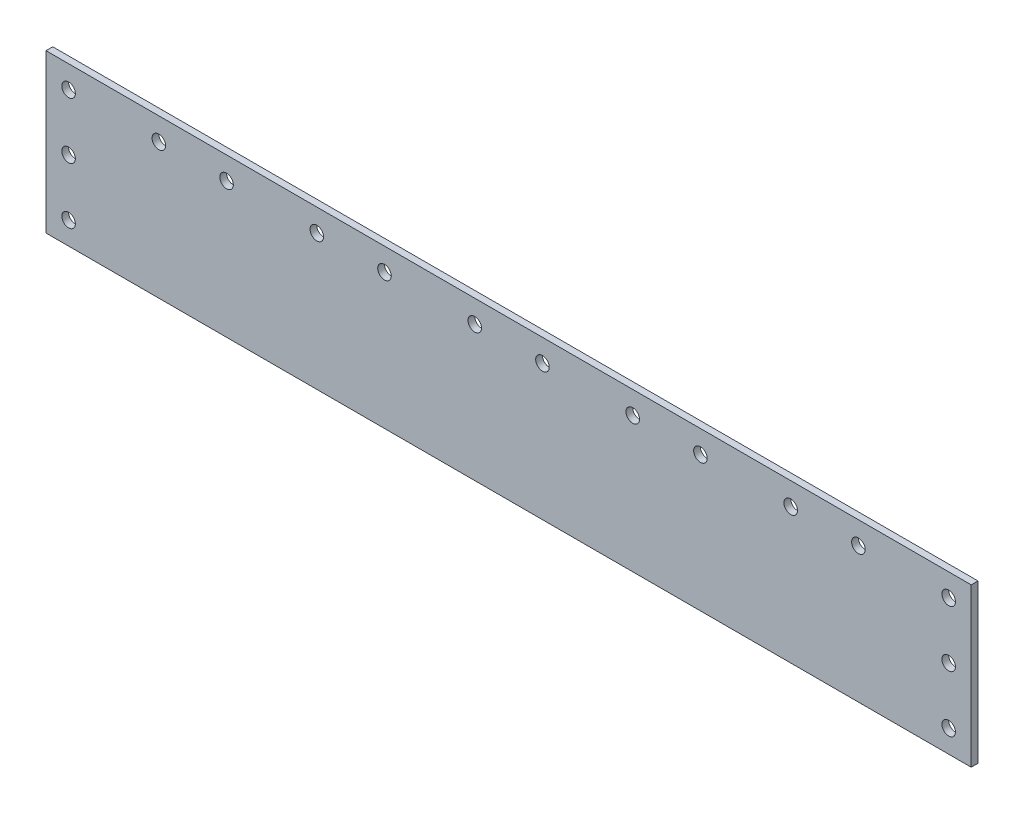
ISO-10303-21;
HEADER;
FILE_DESCRIPTION(('STEP AP214'),'2;1');
FILE_NAME('part.step','',(''),(''),'','','');
FILE_SCHEMA(('AUTOMOTIVE_DESIGN { 1 0 10303 214 1 1 1 1 }'));
ENDSEC;
DATA;
#1=APPLICATION_CONTEXT('core data for automotive mechanical design processes');
#2=APPLICATION_PROTOCOL_DEFINITION('international standard','automotive_design',2000,#1);
#3=PRODUCT_CONTEXT('',#1,'mechanical');
#4=PRODUCT('Part','Part','',(#3));
#5=PRODUCT_RELATED_PRODUCT_CATEGORY('part','',(#4));
#6=PRODUCT_DEFINITION_FORMATION('','',#4);
#7=PRODUCT_DEFINITION_CONTEXT('part definition',#1,'design');
#8=PRODUCT_DEFINITION('design','',#6,#7);
#9=PRODUCT_DEFINITION_SHAPE('','',#8);
#10=(LENGTH_UNIT() NAMED_UNIT(*) SI_UNIT(.MILLI.,.METRE.));
#11=(NAMED_UNIT(*) PLANE_ANGLE_UNIT() SI_UNIT($,.RADIAN.));
#12=(NAMED_UNIT(*) SI_UNIT($,.STERADIAN.) SOLID_ANGLE_UNIT());
#13=UNCERTAINTY_MEASURE_WITH_UNIT(LENGTH_MEASURE(1.E-05),#10,'distance_accuracy_value','');
#14=(GEOMETRIC_REPRESENTATION_CONTEXT(3) GLOBAL_UNCERTAINTY_ASSIGNED_CONTEXT((#13)) GLOBAL_UNIT_ASSIGNED_CONTEXT((#10,
#11,#12)) REPRESENTATION_CONTEXT('',''));
#15=CARTESIAN_POINT('',(0.,0.,0.));
#16=DIRECTION('',(0.,0.,1.));
#17=DIRECTION('',(1.,0.,0.));
#18=AXIS2_PLACEMENT_3D('',#15,#16,#17);
#19=CARTESIAN_POINT('',(0.,0.,3.));
#20=DIRECTION('',(0.,0.,-1.));
#21=DIRECTION('',(-1.,0.,0.));
#22=AXIS2_PLACEMENT_3D('',#19,#20,#21);
#23=PLANE('',#22);
#24=CARTESIAN_POINT('',(400.,35.,3.));
#25=DIRECTION('',(0.,0.,1.));
#26=DIRECTION('',(1.,0.,0.));
#27=AXIS2_PLACEMENT_3D('',#24,#25,#26);
#28=CIRCLE('',#27,2.99999999999999);
#29=CARTESIAN_POINT('',(403.,35.,3.));
#30=VERTEX_POINT('',#29);
#31=EDGE_CURVE('E192',#30,#30,#28,.T.);
#32=ORIENTED_EDGE('',*,*,#31,.F.);
#33=EDGE_LOOP('',(#32));
#34=FACE_BOUND('',#33,.T.);
#35=CARTESIAN_POINT('',(400.,10.,3.));
#36=DIRECTION('',(0.,0.,1.));
#37=DIRECTION('',(-1.,0.,0.));
#38=AXIS2_PLACEMENT_3D('',#35,#36,#37);
#39=CIRCLE('',#38,2.99999999999999);
#40=CARTESIAN_POINT('',(397.,10.,3.));
#41=VERTEX_POINT('',#40);
#42=EDGE_CURVE('E180',#41,#41,#39,.T.);
#43=ORIENTED_EDGE('',*,*,#42,.F.);
#44=EDGE_LOOP('',(#43));
#45=FACE_BOUND('',#44,.T.);
#46=CARTESIAN_POINT('',(360.,60.,3.));
#47=DIRECTION('',(0.,0.,1.));
#48=DIRECTION('',(1.,0.,0.));
#49=AXIS2_PLACEMENT_3D('',#46,#47,#48);
#50=CIRCLE('',#49,2.99999999999999);
#51=CARTESIAN_POINT('',(363.,60.,3.));
#52=VERTEX_POINT('',#51);
#53=EDGE_CURVE('E168',#52,#52,#50,.T.);
#54=ORIENTED_EDGE('',*,*,#53,.F.);
#55=EDGE_LOOP('',(#54));
#56=FACE_BOUND('',#55,.T.);
#57=CARTESIAN_POINT('',(290.,60.,3.));
#58=DIRECTION('',(0.,0.,1.));
#59=DIRECTION('',(1.,0.,0.));
#60=AXIS2_PLACEMENT_3D('',#57,#58,#59);
#61=CIRCLE('',#60,2.99999999999999);
#62=CARTESIAN_POINT('',(293.,60.,3.));
#63=VERTEX_POINT('',#62);
#64=EDGE_CURVE('E156',#63,#63,#61,.T.);
#65=ORIENTED_EDGE('',*,*,#64,.F.);
#66=EDGE_LOOP('',(#65));
#67=FACE_BOUND('',#66,.T.);
#68=CARTESIAN_POINT('',(220.,60.,3.));
#69=DIRECTION('',(0.,0.,1.));
#70=DIRECTION('',(1.,0.,0.));
#71=AXIS2_PLACEMENT_3D('',#68,#69,#70);
#72=CIRCLE('',#71,2.99999999999999);
#73=CARTESIAN_POINT('',(223.,60.,3.));
#74=VERTEX_POINT('',#73);
#75=EDGE_CURVE('E144',#74,#74,#72,.T.);
#76=ORIENTED_EDGE('',*,*,#75,.F.);
#77=EDGE_LOOP('',(#76));
#78=FACE_BOUND('',#77,.T.);
#79=CARTESIAN_POINT('',(150.,60.,3.));
#80=DIRECTION('',(0.,0.,1.));
#81=DIRECTION('',(1.,0.,0.));
#82=AXIS2_PLACEMENT_3D('',#79,#80,#81);
#83=CIRCLE('',#82,2.99999999999999);
#84=CARTESIAN_POINT('',(153.,60.,3.));
#85=VERTEX_POINT('',#84);
#86=EDGE_CURVE('E132',#85,#85,#83,.T.);
#87=ORIENTED_EDGE('',*,*,#86,.F.);
#88=EDGE_LOOP('',(#87));
#89=FACE_BOUND('',#88,.T.);
#90=CARTESIAN_POINT('',(80.,60.,3.));
#91=DIRECTION('',(0.,0.,1.));
#92=DIRECTION('',(1.,0.,0.));
#93=AXIS2_PLACEMENT_3D('',#90,#91,#92);
#94=CIRCLE('',#93,3.00000000000001);
#95=CARTESIAN_POINT('',(83.,60.,3.));
#96=VERTEX_POINT('',#95);
#97=EDGE_CURVE('E120',#96,#96,#94,.T.);
#98=ORIENTED_EDGE('',*,*,#97,.F.);
#99=EDGE_LOOP('',(#98));
#100=FACE_BOUND('',#99,.T.);
#101=CARTESIAN_POINT('',(10.,60.,3.));
#102=DIRECTION('',(0.,0.,1.));
#103=DIRECTION('',(1.,0.,0.));
#104=AXIS2_PLACEMENT_3D('',#101,#102,#103);
#105=CIRCLE('',#104,3.);
#106=CARTESIAN_POINT('',(13.,60.,3.));
#107=VERTEX_POINT('',#106);
#108=EDGE_CURVE('E99',#107,#107,#105,.T.);
#109=ORIENTED_EDGE('',*,*,#108,.F.);
#110=EDGE_LOOP('',(#109));
#111=FACE_BOUND('',#110,.T.);
#112=DIRECTION('',(0.,-1.,0.));
#113=VECTOR('',#112,1.);
#114=CARTESIAN_POINT('',(0.,0.,3.));
#115=LINE('',#114,#113);
#116=CARTESIAN_POINT('',(0.,70.,3.));
#117=VERTEX_POINT('',#116);
#118=CARTESIAN_POINT('',(0.,0.,3.));
#119=VERTEX_POINT('',#118);
#120=EDGE_CURVE('E84',#117,#119,#115,.T.);
#121=ORIENTED_EDGE('',*,*,#120,.T.);
#122=DIRECTION('',(1.,0.,0.));
#123=VECTOR('',#122,1.);
#124=CARTESIAN_POINT('',(0.,0.,3.));
#125=LINE('',#124,#123);
#126=CARTESIAN_POINT('',(410.,0.,3.));
#127=VERTEX_POINT('',#126);
#128=EDGE_CURVE('E79',#119,#127,#125,.T.);
#129=ORIENTED_EDGE('',*,*,#128,.T.);
#130=DIRECTION('',(0.,1.,0.));
#131=VECTOR('',#130,1.);
#132=CARTESIAN_POINT('',(410.,0.,3.));
#133=LINE('',#132,#131);
#134=CARTESIAN_POINT('',(410.,70.,3.));
#135=VERTEX_POINT('',#134);
#136=EDGE_CURVE('E82',#127,#135,#133,.T.);
#137=ORIENTED_EDGE('',*,*,#136,.T.);
#138=DIRECTION('',(-1.,0.,0.));
#139=VECTOR('',#138,1.);
#140=CARTESIAN_POINT('',(0.,70.,3.));
#141=LINE('',#140,#139);
#142=EDGE_CURVE('E49',#135,#117,#141,.T.);
#143=ORIENTED_EDGE('',*,*,#142,.T.);
#144=EDGE_LOOP('',(#121,#129,#137,#143));
#145=FACE_BOUND('',#144,.T.);
#146=CARTESIAN_POINT('',(50.,60.,3.));
#147=DIRECTION('',(0.,0.,1.));
#148=DIRECTION('',(1.,0.,0.));
#149=AXIS2_PLACEMENT_3D('',#146,#147,#148);
#150=CIRCLE('',#149,3.);
#151=CARTESIAN_POINT('',(53.,60.,3.));
#152=VERTEX_POINT('',#151);
#153=EDGE_CURVE('E114',#152,#152,#150,.T.);
#154=ORIENTED_EDGE('',*,*,#153,.F.);
#155=EDGE_LOOP('',(#154));
#156=FACE_BOUND('',#155,.T.);
#157=CARTESIAN_POINT('',(120.,60.,3.));
#158=DIRECTION('',(0.,0.,1.));
#159=DIRECTION('',(1.,0.,0.));
#160=AXIS2_PLACEMENT_3D('',#157,#158,#159);
#161=CIRCLE('',#160,3.00000000000001);
#162=CARTESIAN_POINT('',(123.,60.,3.));
#163=VERTEX_POINT('',#162);
#164=EDGE_CURVE('E126',#163,#163,#161,.T.);
#165=ORIENTED_EDGE('',*,*,#164,.F.);
#166=EDGE_LOOP('',(#165));
#167=FACE_BOUND('',#166,.T.);
#168=CARTESIAN_POINT('',(190.,60.,3.));
#169=DIRECTION('',(0.,0.,1.));
#170=DIRECTION('',(1.,0.,0.));
#171=AXIS2_PLACEMENT_3D('',#168,#169,#170);
#172=CIRCLE('',#171,2.99999999999999);
#173=CARTESIAN_POINT('',(193.,60.,3.));
#174=VERTEX_POINT('',#173);
#175=EDGE_CURVE('E138',#174,#174,#172,.T.);
#176=ORIENTED_EDGE('',*,*,#175,.F.);
#177=EDGE_LOOP('',(#176));
#178=FACE_BOUND('',#177,.T.);
#179=CARTESIAN_POINT('',(260.,60.,3.));
#180=DIRECTION('',(0.,0.,1.));
#181=DIRECTION('',(1.,0.,0.));
#182=AXIS2_PLACEMENT_3D('',#179,#180,#181);
#183=CIRCLE('',#182,2.99999999999999);
#184=CARTESIAN_POINT('',(263.,60.,3.));
#185=VERTEX_POINT('',#184);
#186=EDGE_CURVE('E150',#185,#185,#183,.T.);
#187=ORIENTED_EDGE('',*,*,#186,.F.);
#188=EDGE_LOOP('',(#187));
#189=FACE_BOUND('',#188,.T.);
#190=CARTESIAN_POINT('',(330.,60.,3.));
#191=DIRECTION('',(0.,0.,1.));
#192=DIRECTION('',(1.,0.,0.));
#193=AXIS2_PLACEMENT_3D('',#190,#191,#192);
#194=CIRCLE('',#193,2.99999999999999);
#195=CARTESIAN_POINT('',(333.,60.,3.));
#196=VERTEX_POINT('',#195);
#197=EDGE_CURVE('E162',#196,#196,#194,.T.);
#198=ORIENTED_EDGE('',*,*,#197,.F.);
#199=EDGE_LOOP('',(#198));
#200=FACE_BOUND('',#199,.T.);
#201=CARTESIAN_POINT('',(400.,60.,3.));
#202=DIRECTION('',(0.,0.,1.));
#203=DIRECTION('',(1.,0.,0.));
#204=AXIS2_PLACEMENT_3D('',#201,#202,#203);
#205=CIRCLE('',#204,2.99999999999999);
#206=CARTESIAN_POINT('',(403.,60.,3.));
#207=VERTEX_POINT('',#206);
#208=EDGE_CURVE('E174',#207,#207,#205,.T.);
#209=ORIENTED_EDGE('',*,*,#208,.F.);
#210=EDGE_LOOP('',(#209));
#211=FACE_BOUND('',#210,.T.);
#212=CARTESIAN_POINT('',(9.99999999999999,10.,3.));
#213=DIRECTION('',(0.,0.,1.));
#214=DIRECTION('',(-1.,0.,0.));
#215=AXIS2_PLACEMENT_3D('',#212,#213,#214);
#216=CIRCLE('',#215,3.);
#217=CARTESIAN_POINT('',(6.99999999999999,10.,3.));
#218=VERTEX_POINT('',#217);
#219=EDGE_CURVE('E186',#218,#218,#216,.T.);
#220=ORIENTED_EDGE('',*,*,#219,.F.);
#221=EDGE_LOOP('',(#220));
#222=FACE_BOUND('',#221,.T.);
#223=CARTESIAN_POINT('',(10.,35.,3.));
#224=DIRECTION('',(0.,0.,1.));
#225=DIRECTION('',(1.,0.,0.));
#226=AXIS2_PLACEMENT_3D('',#223,#224,#225);
#227=CIRCLE('',#226,3.);
#228=CARTESIAN_POINT('',(13.,35.,3.));
#229=VERTEX_POINT('',#228);
#230=EDGE_CURVE('E198',#229,#229,#227,.T.);
#231=ORIENTED_EDGE('',*,*,#230,.F.);
#232=EDGE_LOOP('',(#231));
#233=FACE_BOUND('',#232,.T.);
#234=ADVANCED_FACE('F32',(#34,#45,#56,#67,#78,#89,#100,#111,#145,#156,#167,#178,#189,#200,#211,
#222,#233),#23,.F.);
#235=CARTESIAN_POINT('',(0.,0.,0.));
#236=DIRECTION('',(0.,0.,-1.));
#237=DIRECTION('',(-1.,0.,0.));
#238=AXIS2_PLACEMENT_3D('',#235,#236,#237);
#239=PLANE('',#238);
#240=CARTESIAN_POINT('',(400.,35.,0.));
#241=DIRECTION('',(0.,0.,1.));
#242=DIRECTION('',(1.,0.,0.));
#243=AXIS2_PLACEMENT_3D('',#240,#241,#242);
#244=CIRCLE('',#243,2.99999999999999);
#245=CARTESIAN_POINT('',(403.,35.,0.));
#246=VERTEX_POINT('',#245);
#247=EDGE_CURVE('E195',#246,#246,#244,.T.);
#248=ORIENTED_EDGE('',*,*,#247,.T.);
#249=EDGE_LOOP('',(#248));
#250=FACE_BOUND('',#249,.T.);
#251=CARTESIAN_POINT('',(400.,10.,0.));
#252=DIRECTION('',(0.,0.,1.));
#253=DIRECTION('',(-1.,0.,0.));
#254=AXIS2_PLACEMENT_3D('',#251,#252,#253);
#255=CIRCLE('',#254,2.99999999999999);
#256=CARTESIAN_POINT('',(397.,10.,0.));
#257=VERTEX_POINT('',#256);
#258=EDGE_CURVE('E183',#257,#257,#255,.T.);
#259=ORIENTED_EDGE('',*,*,#258,.T.);
#260=EDGE_LOOP('',(#259));
#261=FACE_BOUND('',#260,.T.);
#262=CARTESIAN_POINT('',(360.,60.,0.));
#263=DIRECTION('',(0.,0.,1.));
#264=DIRECTION('',(1.,0.,0.));
#265=AXIS2_PLACEMENT_3D('',#262,#263,#264);
#266=CIRCLE('',#265,2.99999999999999);
#267=CARTESIAN_POINT('',(363.,60.,0.));
#268=VERTEX_POINT('',#267);
#269=EDGE_CURVE('E171',#268,#268,#266,.T.);
#270=ORIENTED_EDGE('',*,*,#269,.T.);
#271=EDGE_LOOP('',(#270));
#272=FACE_BOUND('',#271,.T.);
#273=CARTESIAN_POINT('',(290.,60.,0.));
#274=DIRECTION('',(0.,0.,1.));
#275=DIRECTION('',(1.,0.,0.));
#276=AXIS2_PLACEMENT_3D('',#273,#274,#275);
#277=CIRCLE('',#276,2.99999999999999);
#278=CARTESIAN_POINT('',(293.,60.,0.));
#279=VERTEX_POINT('',#278);
#280=EDGE_CURVE('E159',#279,#279,#277,.T.);
#281=ORIENTED_EDGE('',*,*,#280,.T.);
#282=EDGE_LOOP('',(#281));
#283=FACE_BOUND('',#282,.T.);
#284=CARTESIAN_POINT('',(220.,60.,0.));
#285=DIRECTION('',(0.,0.,1.));
#286=DIRECTION('',(1.,0.,0.));
#287=AXIS2_PLACEMENT_3D('',#284,#285,#286);
#288=CIRCLE('',#287,2.99999999999999);
#289=CARTESIAN_POINT('',(223.,60.,0.));
#290=VERTEX_POINT('',#289);
#291=EDGE_CURVE('E147',#290,#290,#288,.T.);
#292=ORIENTED_EDGE('',*,*,#291,.T.);
#293=EDGE_LOOP('',(#292));
#294=FACE_BOUND('',#293,.T.);
#295=CARTESIAN_POINT('',(150.,60.,0.));
#296=DIRECTION('',(0.,0.,1.));
#297=DIRECTION('',(1.,0.,0.));
#298=AXIS2_PLACEMENT_3D('',#295,#296,#297);
#299=CIRCLE('',#298,2.99999999999999);
#300=CARTESIAN_POINT('',(153.,60.,0.));
#301=VERTEX_POINT('',#300);
#302=EDGE_CURVE('E135',#301,#301,#299,.T.);
#303=ORIENTED_EDGE('',*,*,#302,.T.);
#304=EDGE_LOOP('',(#303));
#305=FACE_BOUND('',#304,.T.);
#306=CARTESIAN_POINT('',(80.,60.,0.));
#307=DIRECTION('',(0.,0.,1.));
#308=DIRECTION('',(1.,0.,0.));
#309=AXIS2_PLACEMENT_3D('',#306,#307,#308);
#310=CIRCLE('',#309,3.00000000000001);
#311=CARTESIAN_POINT('',(83.,60.,0.));
#312=VERTEX_POINT('',#311);
#313=EDGE_CURVE('E123',#312,#312,#310,.T.);
#314=ORIENTED_EDGE('',*,*,#313,.T.);
#315=EDGE_LOOP('',(#314));
#316=FACE_BOUND('',#315,.T.);
#317=CARTESIAN_POINT('',(10.,60.,0.));
#318=DIRECTION('',(0.,0.,1.));
#319=DIRECTION('',(1.,0.,0.));
#320=AXIS2_PLACEMENT_3D('',#317,#318,#319);
#321=CIRCLE('',#320,3.);
#322=CARTESIAN_POINT('',(13.,60.,0.));
#323=VERTEX_POINT('',#322);
#324=EDGE_CURVE('E111',#323,#323,#321,.T.);
#325=ORIENTED_EDGE('',*,*,#324,.T.);
#326=EDGE_LOOP('',(#325));
#327=FACE_BOUND('',#326,.T.);
#328=DIRECTION('',(0.,-1.,0.));
#329=VECTOR('',#328,1.);
#330=CARTESIAN_POINT('',(0.,0.,0.));
#331=LINE('',#330,#329);
#332=CARTESIAN_POINT('',(0.,70.,0.));
#333=VERTEX_POINT('',#332);
#334=CARTESIAN_POINT('',(0.,0.,0.));
#335=VERTEX_POINT('',#334);
#336=EDGE_CURVE('E96',#333,#335,#331,.T.);
#337=ORIENTED_EDGE('',*,*,#336,.F.);
#338=DIRECTION('',(-1.,0.,0.));
#339=VECTOR('',#338,1.);
#340=CARTESIAN_POINT('',(0.,70.,0.));
#341=LINE('',#340,#339);
#342=CARTESIAN_POINT('',(410.,70.,0.));
#343=VERTEX_POINT('',#342);
#344=EDGE_CURVE('E72',#343,#333,#341,.T.);
#345=ORIENTED_EDGE('',*,*,#344,.F.);
#346=DIRECTION('',(0.,1.,0.));
#347=VECTOR('',#346,1.);
#348=CARTESIAN_POINT('',(410.,0.,0.));
#349=LINE('',#348,#347);
#350=CARTESIAN_POINT('',(410.,0.,0.));
#351=VERTEX_POINT('',#350);
#352=EDGE_CURVE('E66',#351,#343,#349,.T.);
#353=ORIENTED_EDGE('',*,*,#352,.F.);
#354=DIRECTION('',(1.,0.,0.));
#355=VECTOR('',#354,1.);
#356=CARTESIAN_POINT('',(0.,0.,0.));
#357=LINE('',#356,#355);
#358=EDGE_CURVE('E88',#335,#351,#357,.T.);
#359=ORIENTED_EDGE('',*,*,#358,.F.);
#360=EDGE_LOOP('',(#337,#345,#353,#359));
#361=FACE_BOUND('',#360,.T.);
#362=CARTESIAN_POINT('',(50.,60.,0.));
#363=DIRECTION('',(0.,0.,1.));
#364=DIRECTION('',(1.,0.,0.));
#365=AXIS2_PLACEMENT_3D('',#362,#363,#364);
#366=CIRCLE('',#365,3.);
#367=CARTESIAN_POINT('',(53.,60.,0.));
#368=VERTEX_POINT('',#367);
#369=EDGE_CURVE('E117',#368,#368,#366,.T.);
#370=ORIENTED_EDGE('',*,*,#369,.T.);
#371=EDGE_LOOP('',(#370));
#372=FACE_BOUND('',#371,.T.);
#373=CARTESIAN_POINT('',(120.,60.,0.));
#374=DIRECTION('',(0.,0.,1.));
#375=DIRECTION('',(1.,0.,0.));
#376=AXIS2_PLACEMENT_3D('',#373,#374,#375);
#377=CIRCLE('',#376,3.00000000000001);
#378=CARTESIAN_POINT('',(123.,60.,0.));
#379=VERTEX_POINT('',#378);
#380=EDGE_CURVE('E129',#379,#379,#377,.T.);
#381=ORIENTED_EDGE('',*,*,#380,.T.);
#382=EDGE_LOOP('',(#381));
#383=FACE_BOUND('',#382,.T.);
#384=CARTESIAN_POINT('',(190.,60.,0.));
#385=DIRECTION('',(0.,0.,1.));
#386=DIRECTION('',(1.,0.,0.));
#387=AXIS2_PLACEMENT_3D('',#384,#385,#386);
#388=CIRCLE('',#387,2.99999999999999);
#389=CARTESIAN_POINT('',(193.,60.,0.));
#390=VERTEX_POINT('',#389);
#391=EDGE_CURVE('E141',#390,#390,#388,.T.);
#392=ORIENTED_EDGE('',*,*,#391,.T.);
#393=EDGE_LOOP('',(#392));
#394=FACE_BOUND('',#393,.T.);
#395=CARTESIAN_POINT('',(260.,60.,0.));
#396=DIRECTION('',(0.,0.,1.));
#397=DIRECTION('',(1.,0.,0.));
#398=AXIS2_PLACEMENT_3D('',#395,#396,#397);
#399=CIRCLE('',#398,2.99999999999999);
#400=CARTESIAN_POINT('',(263.,60.,0.));
#401=VERTEX_POINT('',#400);
#402=EDGE_CURVE('E153',#401,#401,#399,.T.);
#403=ORIENTED_EDGE('',*,*,#402,.T.);
#404=EDGE_LOOP('',(#403));
#405=FACE_BOUND('',#404,.T.);
#406=CARTESIAN_POINT('',(330.,60.,0.));
#407=DIRECTION('',(0.,0.,1.));
#408=DIRECTION('',(1.,0.,0.));
#409=AXIS2_PLACEMENT_3D('',#406,#407,#408);
#410=CIRCLE('',#409,2.99999999999999);
#411=CARTESIAN_POINT('',(333.,60.,0.));
#412=VERTEX_POINT('',#411);
#413=EDGE_CURVE('E165',#412,#412,#410,.T.);
#414=ORIENTED_EDGE('',*,*,#413,.T.);
#415=EDGE_LOOP('',(#414));
#416=FACE_BOUND('',#415,.T.);
#417=CARTESIAN_POINT('',(400.,60.,0.));
#418=DIRECTION('',(0.,0.,1.));
#419=DIRECTION('',(1.,0.,0.));
#420=AXIS2_PLACEMENT_3D('',#417,#418,#419);
#421=CIRCLE('',#420,2.99999999999999);
#422=CARTESIAN_POINT('',(403.,60.,0.));
#423=VERTEX_POINT('',#422);
#424=EDGE_CURVE('E177',#423,#423,#421,.T.);
#425=ORIENTED_EDGE('',*,*,#424,.T.);
#426=EDGE_LOOP('',(#425));
#427=FACE_BOUND('',#426,.T.);
#428=CARTESIAN_POINT('',(9.99999999999999,10.,0.));
#429=DIRECTION('',(0.,0.,1.));
#430=DIRECTION('',(-1.,0.,0.));
#431=AXIS2_PLACEMENT_3D('',#428,#429,#430);
#432=CIRCLE('',#431,3.);
#433=CARTESIAN_POINT('',(6.99999999999999,10.,0.));
#434=VERTEX_POINT('',#433);
#435=EDGE_CURVE('E189',#434,#434,#432,.T.);
#436=ORIENTED_EDGE('',*,*,#435,.T.);
#437=EDGE_LOOP('',(#436));
#438=FACE_BOUND('',#437,.T.);
#439=CARTESIAN_POINT('',(10.,35.,0.));
#440=DIRECTION('',(0.,0.,1.));
#441=DIRECTION('',(1.,0.,0.));
#442=AXIS2_PLACEMENT_3D('',#439,#440,#441);
#443=CIRCLE('',#442,3.);
#444=CARTESIAN_POINT('',(13.,35.,0.));
#445=VERTEX_POINT('',#444);
#446=EDGE_CURVE('E201',#445,#445,#443,.T.);
#447=ORIENTED_EDGE('',*,*,#446,.T.);
#448=EDGE_LOOP('',(#447));
#449=FACE_BOUND('',#448,.T.);
#450=ADVANCED_FACE('F107',(#250,#261,#272,#283,#294,#305,#316,#327,#361,#372,#383,#394,#405,
#416,#427,#438,#449),#239,.T.);
#451=CARTESIAN_POINT('',(0.,0.,3.));
#452=DIRECTION('',(1.,0.,0.));
#453=DIRECTION('',(0.,0.,-1.));
#454=AXIS2_PLACEMENT_3D('',#451,#452,#453);
#455=PLANE('',#454);
#456=ORIENTED_EDGE('',*,*,#336,.T.);
#457=DIRECTION('',(0.,0.,-1.));
#458=VECTOR('',#457,1.);
#459=CARTESIAN_POINT('',(0.,0.,3.));
#460=LINE('',#459,#458);
#461=EDGE_CURVE('E11',#119,#335,#460,.T.);
#462=ORIENTED_EDGE('',*,*,#461,.F.);
#463=ORIENTED_EDGE('',*,*,#120,.F.);
#464=DIRECTION('',(0.,0.,-1.));
#465=VECTOR('',#464,1.);
#466=CARTESIAN_POINT('',(0.,70.,3.));
#467=LINE('',#466,#465);
#468=EDGE_CURVE('E92',#117,#333,#467,.T.);
#469=ORIENTED_EDGE('',*,*,#468,.T.);
#470=EDGE_LOOP('',(#456,#462,#463,#469));
#471=FACE_BOUND('',#470,.T.);
#472=ADVANCED_FACE('F34',(#471),#455,.F.);
#473=CARTESIAN_POINT('',(0.,0.,3.));
#474=DIRECTION('',(0.,1.,0.));
#475=DIRECTION('',(0.,0.,1.));
#476=AXIS2_PLACEMENT_3D('',#473,#474,#475);
#477=PLANE('',#476);
#478=ORIENTED_EDGE('',*,*,#358,.T.);
#479=DIRECTION('',(0.,0.,-1.));
#480=VECTOR('',#479,1.);
#481=CARTESIAN_POINT('',(410.,0.,3.));
#482=LINE('',#481,#480);
#483=EDGE_CURVE('E41',#127,#351,#482,.T.);
#484=ORIENTED_EDGE('',*,*,#483,.F.);
#485=ORIENTED_EDGE('',*,*,#128,.F.);
#486=ORIENTED_EDGE('',*,*,#461,.T.);
#487=EDGE_LOOP('',(#478,#484,#485,#486));
#488=FACE_BOUND('',#487,.T.);
#489=ADVANCED_FACE('F87',(#488),#477,.F.);
#490=CARTESIAN_POINT('',(410.,0.,3.));
#491=DIRECTION('',(-1.,0.,0.));
#492=DIRECTION('',(0.,0.,1.));
#493=AXIS2_PLACEMENT_3D('',#490,#491,#492);
#494=PLANE('',#493);
#495=ORIENTED_EDGE('',*,*,#352,.T.);
#496=DIRECTION('',(0.,0.,-1.));
#497=VECTOR('',#496,1.);
#498=CARTESIAN_POINT('',(410.,70.,3.));
#499=LINE('',#498,#497);
#500=EDGE_CURVE('E89',#135,#343,#499,.T.);
#501=ORIENTED_EDGE('',*,*,#500,.F.);
#502=ORIENTED_EDGE('',*,*,#136,.F.);
#503=ORIENTED_EDGE('',*,*,#483,.T.);
#504=EDGE_LOOP('',(#495,#501,#502,#503));
#505=FACE_BOUND('',#504,.T.);
#506=ADVANCED_FACE('F90',(#505),#494,.F.);
#507=CARTESIAN_POINT('',(0.,70.,3.));
#508=DIRECTION('',(0.,-1.,0.));
#509=DIRECTION('',(0.,0.,-1.));
#510=AXIS2_PLACEMENT_3D('',#507,#508,#509);
#511=PLANE('',#510);
#512=ORIENTED_EDGE('',*,*,#344,.T.);
#513=ORIENTED_EDGE('',*,*,#468,.F.);
#514=ORIENTED_EDGE('',*,*,#142,.F.);
#515=ORIENTED_EDGE('',*,*,#500,.T.);
#516=EDGE_LOOP('',(#512,#513,#514,#515));
#517=FACE_BOUND('',#516,.T.);
#518=ADVANCED_FACE('F104',(#517),#511,.F.);
#519=CARTESIAN_POINT('',(10.,60.,3.));
#520=DIRECTION('',(0.,0.,-1.));
#521=DIRECTION('',(-1.,0.,0.));
#522=AXIS2_PLACEMENT_3D('',#519,#520,#521);
#523=CYLINDRICAL_SURFACE('',#522,3.);
#524=ORIENTED_EDGE('',*,*,#108,.T.);
#525=EDGE_LOOP('',(#524));
#526=FACE_BOUND('',#525,.T.);
#527=ORIENTED_EDGE('',*,*,#324,.F.);
#528=EDGE_LOOP('',(#527));
#529=FACE_BOUND('',#528,.T.);
#530=ADVANCED_FACE('F221',(#526,#529),#523,.F.);
#531=CARTESIAN_POINT('',(50.,60.,3.));
#532=DIRECTION('',(0.,0.,-1.));
#533=DIRECTION('',(-1.,0.,0.));
#534=AXIS2_PLACEMENT_3D('',#531,#532,#533);
#535=CYLINDRICAL_SURFACE('',#534,3.);
#536=ORIENTED_EDGE('',*,*,#153,.T.);
#537=EDGE_LOOP('',(#536));
#538=FACE_BOUND('',#537,.T.);
#539=ORIENTED_EDGE('',*,*,#369,.F.);
#540=EDGE_LOOP('',(#539));
#541=FACE_BOUND('',#540,.T.);
#542=ADVANCED_FACE('F256',(#538,#541),#535,.F.);
#543=CARTESIAN_POINT('',(80.,60.,3.));
#544=DIRECTION('',(0.,0.,-1.));
#545=DIRECTION('',(-1.,0.,0.));
#546=AXIS2_PLACEMENT_3D('',#543,#544,#545);
#547=CYLINDRICAL_SURFACE('',#546,3.00000000000001);
#548=ORIENTED_EDGE('',*,*,#97,.T.);
#549=EDGE_LOOP('',(#548));
#550=FACE_BOUND('',#549,.T.);
#551=ORIENTED_EDGE('',*,*,#313,.F.);
#552=EDGE_LOOP('',(#551));
#553=FACE_BOUND('',#552,.T.);
#554=ADVANCED_FACE('F263',(#550,#553),#547,.F.);
#555=CARTESIAN_POINT('',(120.,60.,3.));
#556=DIRECTION('',(0.,0.,-1.));
#557=DIRECTION('',(-1.,0.,0.));
#558=AXIS2_PLACEMENT_3D('',#555,#556,#557);
#559=CYLINDRICAL_SURFACE('',#558,3.00000000000001);
#560=ORIENTED_EDGE('',*,*,#164,.T.);
#561=EDGE_LOOP('',(#560));
#562=FACE_BOUND('',#561,.T.);
#563=ORIENTED_EDGE('',*,*,#380,.F.);
#564=EDGE_LOOP('',(#563));
#565=FACE_BOUND('',#564,.T.);
#566=ADVANCED_FACE('F270',(#562,#565),#559,.F.);
#567=CARTESIAN_POINT('',(150.,60.,3.));
#568=DIRECTION('',(0.,0.,-1.));
#569=DIRECTION('',(-1.,0.,0.));
#570=AXIS2_PLACEMENT_3D('',#567,#568,#569);
#571=CYLINDRICAL_SURFACE('',#570,2.99999999999999);
#572=ORIENTED_EDGE('',*,*,#86,.T.);
#573=EDGE_LOOP('',(#572));
#574=FACE_BOUND('',#573,.T.);
#575=ORIENTED_EDGE('',*,*,#302,.F.);
#576=EDGE_LOOP('',(#575));
#577=FACE_BOUND('',#576,.T.);
#578=ADVANCED_FACE('F278',(#574,#577),#571,.F.);
#579=CARTESIAN_POINT('',(190.,60.,3.));
#580=DIRECTION('',(0.,0.,-1.));
#581=DIRECTION('',(-1.,0.,0.));
#582=AXIS2_PLACEMENT_3D('',#579,#580,#581);
#583=CYLINDRICAL_SURFACE('',#582,2.99999999999999);
#584=ORIENTED_EDGE('',*,*,#175,.T.);
#585=EDGE_LOOP('',(#584));
#586=FACE_BOUND('',#585,.T.);
#587=ORIENTED_EDGE('',*,*,#391,.F.);
#588=EDGE_LOOP('',(#587));
#589=FACE_BOUND('',#588,.T.);
#590=ADVANCED_FACE('F286',(#586,#589),#583,.F.);
#591=CARTESIAN_POINT('',(220.,60.,3.));
#592=DIRECTION('',(0.,0.,-1.));
#593=DIRECTION('',(-1.,0.,0.));
#594=AXIS2_PLACEMENT_3D('',#591,#592,#593);
#595=CYLINDRICAL_SURFACE('',#594,2.99999999999999);
#596=ORIENTED_EDGE('',*,*,#75,.T.);
#597=EDGE_LOOP('',(#596));
#598=FACE_BOUND('',#597,.T.);
#599=ORIENTED_EDGE('',*,*,#291,.F.);
#600=EDGE_LOOP('',(#599));
#601=FACE_BOUND('',#600,.T.);
#602=ADVANCED_FACE('F294',(#598,#601),#595,.F.);
#603=CARTESIAN_POINT('',(260.,60.,3.));
#604=DIRECTION('',(0.,0.,-1.));
#605=DIRECTION('',(-1.,0.,0.));
#606=AXIS2_PLACEMENT_3D('',#603,#604,#605);
#607=CYLINDRICAL_SURFACE('',#606,2.99999999999999);
#608=ORIENTED_EDGE('',*,*,#186,.T.);
#609=EDGE_LOOP('',(#608));
#610=FACE_BOUND('',#609,.T.);
#611=ORIENTED_EDGE('',*,*,#402,.F.);
#612=EDGE_LOOP('',(#611));
#613=FACE_BOUND('',#612,.T.);
#614=ADVANCED_FACE('F302',(#610,#613),#607,.F.);
#615=CARTESIAN_POINT('',(290.,60.,3.));
#616=DIRECTION('',(0.,0.,-1.));
#617=DIRECTION('',(-1.,0.,0.));
#618=AXIS2_PLACEMENT_3D('',#615,#616,#617);
#619=CYLINDRICAL_SURFACE('',#618,2.99999999999999);
#620=ORIENTED_EDGE('',*,*,#64,.T.);
#621=EDGE_LOOP('',(#620));
#622=FACE_BOUND('',#621,.T.);
#623=ORIENTED_EDGE('',*,*,#280,.F.);
#624=EDGE_LOOP('',(#623));
#625=FACE_BOUND('',#624,.T.);
#626=ADVANCED_FACE('F310',(#622,#625),#619,.F.);
#627=CARTESIAN_POINT('',(330.,60.,3.));
#628=DIRECTION('',(0.,0.,-1.));
#629=DIRECTION('',(-1.,0.,0.));
#630=AXIS2_PLACEMENT_3D('',#627,#628,#629);
#631=CYLINDRICAL_SURFACE('',#630,2.99999999999999);
#632=ORIENTED_EDGE('',*,*,#197,.T.);
#633=EDGE_LOOP('',(#632));
#634=FACE_BOUND('',#633,.T.);
#635=ORIENTED_EDGE('',*,*,#413,.F.);
#636=EDGE_LOOP('',(#635));
#637=FACE_BOUND('',#636,.T.);
#638=ADVANCED_FACE('F318',(#634,#637),#631,.F.);
#639=CARTESIAN_POINT('',(360.,60.,3.));
#640=DIRECTION('',(0.,0.,-1.));
#641=DIRECTION('',(-1.,0.,0.));
#642=AXIS2_PLACEMENT_3D('',#639,#640,#641);
#643=CYLINDRICAL_SURFACE('',#642,2.99999999999999);
#644=ORIENTED_EDGE('',*,*,#53,.T.);
#645=EDGE_LOOP('',(#644));
#646=FACE_BOUND('',#645,.T.);
#647=ORIENTED_EDGE('',*,*,#269,.F.);
#648=EDGE_LOOP('',(#647));
#649=FACE_BOUND('',#648,.T.);
#650=ADVANCED_FACE('F326',(#646,#649),#643,.F.);
#651=CARTESIAN_POINT('',(400.,60.,3.));
#652=DIRECTION('',(0.,0.,-1.));
#653=DIRECTION('',(-1.,0.,0.));
#654=AXIS2_PLACEMENT_3D('',#651,#652,#653);
#655=CYLINDRICAL_SURFACE('',#654,2.99999999999999);
#656=ORIENTED_EDGE('',*,*,#208,.T.);
#657=EDGE_LOOP('',(#656));
#658=FACE_BOUND('',#657,.T.);
#659=ORIENTED_EDGE('',*,*,#424,.F.);
#660=EDGE_LOOP('',(#659));
#661=FACE_BOUND('',#660,.T.);
#662=ADVANCED_FACE('F334',(#658,#661),#655,.F.);
#663=CARTESIAN_POINT('',(400.,10.,3.));
#664=DIRECTION('',(0.,0.,-1.));
#665=DIRECTION('',(-1.,0.,0.));
#666=AXIS2_PLACEMENT_3D('',#663,#664,#665);
#667=CYLINDRICAL_SURFACE('',#666,2.99999999999999);
#668=ORIENTED_EDGE('',*,*,#42,.T.);
#669=EDGE_LOOP('',(#668));
#670=FACE_BOUND('',#669,.T.);
#671=ORIENTED_EDGE('',*,*,#258,.F.);
#672=EDGE_LOOP('',(#671));
#673=FACE_BOUND('',#672,.T.);
#674=ADVANCED_FACE('F342',(#670,#673),#667,.F.);
#675=CARTESIAN_POINT('',(9.99999999999999,10.,3.));
#676=DIRECTION('',(0.,0.,-1.));
#677=DIRECTION('',(-1.,0.,0.));
#678=AXIS2_PLACEMENT_3D('',#675,#676,#677);
#679=CYLINDRICAL_SURFACE('',#678,3.);
#680=ORIENTED_EDGE('',*,*,#219,.T.);
#681=EDGE_LOOP('',(#680));
#682=FACE_BOUND('',#681,.T.);
#683=ORIENTED_EDGE('',*,*,#435,.F.);
#684=EDGE_LOOP('',(#683));
#685=FACE_BOUND('',#684,.T.);
#686=ADVANCED_FACE('F350',(#682,#685),#679,.F.);
#687=CARTESIAN_POINT('',(400.,35.,3.));
#688=DIRECTION('',(0.,0.,-1.));
#689=DIRECTION('',(-1.,0.,0.));
#690=AXIS2_PLACEMENT_3D('',#687,#688,#689);
#691=CYLINDRICAL_SURFACE('',#690,2.99999999999999);
#692=ORIENTED_EDGE('',*,*,#31,.T.);
#693=EDGE_LOOP('',(#692));
#694=FACE_BOUND('',#693,.T.);
#695=ORIENTED_EDGE('',*,*,#247,.F.);
#696=EDGE_LOOP('',(#695));
#697=FACE_BOUND('',#696,.T.);
#698=ADVANCED_FACE('F358',(#694,#697),#691,.F.);
#699=CARTESIAN_POINT('',(10.,35.,3.));
#700=DIRECTION('',(0.,0.,-1.));
#701=DIRECTION('',(-1.,0.,0.));
#702=AXIS2_PLACEMENT_3D('',#699,#700,#701);
#703=CYLINDRICAL_SURFACE('',#702,3.);
#704=ORIENTED_EDGE('',*,*,#230,.T.);
#705=EDGE_LOOP('',(#704));
#706=FACE_BOUND('',#705,.T.);
#707=ORIENTED_EDGE('',*,*,#446,.F.);
#708=EDGE_LOOP('',(#707));
#709=FACE_BOUND('',#708,.T.);
#710=ADVANCED_FACE('F207',(#706,#709),#703,.F.);
#711=CLOSED_SHELL('',(#234,#450,#472,#489,#506,#518,#530,#542,#554,#566,#578,#590,#602,#614,
#626,#638,#650,#662,#674,#686,#698,#710));
#712=MANIFOLD_SOLID_BREP('B2',#711);
#713=ADVANCED_BREP_SHAPE_REPRESENTATION('',(#18,#712),#14);
#714=SHAPE_DEFINITION_REPRESENTATION(#9,#713);
ENDSEC;
END-ISO-10303-21;
